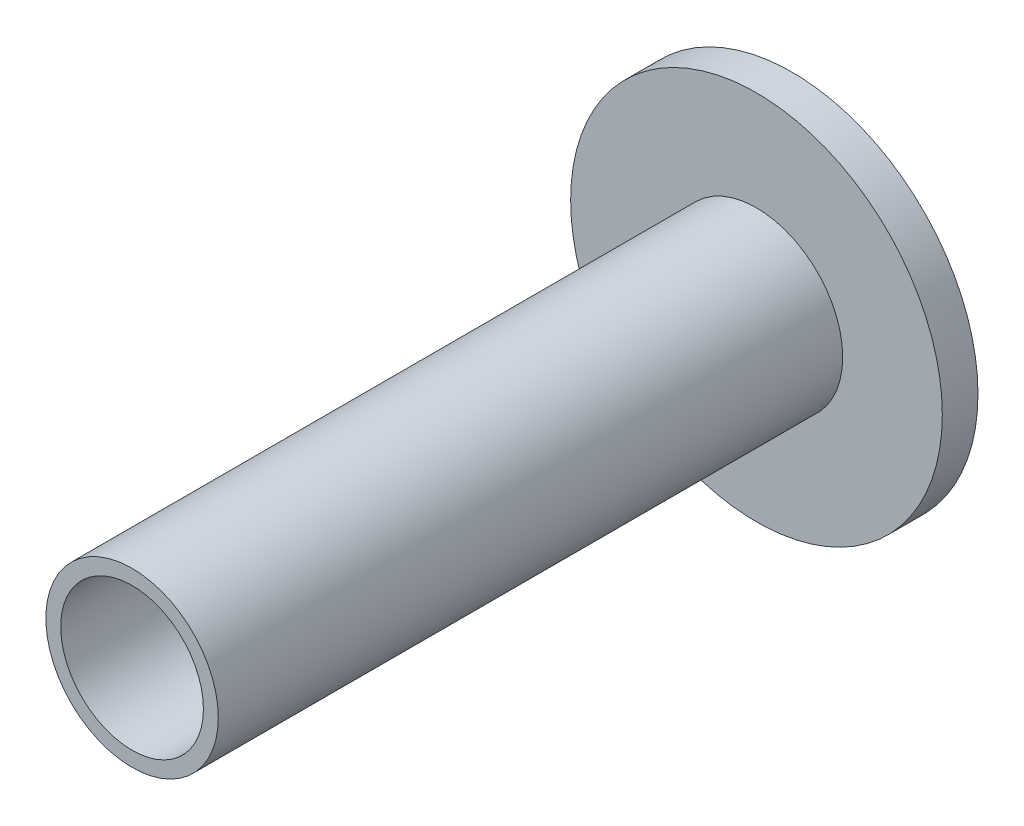
ISO-10303-21;
HEADER;
FILE_DESCRIPTION(('STEP AP214'),'2;1');
FILE_NAME('part.step','',(''),(''),'','','');
FILE_SCHEMA(('AUTOMOTIVE_DESIGN { 1 0 10303 214 1 1 1 1 }'));
ENDSEC;
DATA;
#1=APPLICATION_CONTEXT('core data for automotive mechanical design processes');
#2=APPLICATION_PROTOCOL_DEFINITION('international standard','automotive_design',2000,#1);
#3=PRODUCT_CONTEXT('',#1,'mechanical');
#4=PRODUCT('Part','Part','',(#3));
#5=PRODUCT_RELATED_PRODUCT_CATEGORY('part','',(#4));
#6=PRODUCT_DEFINITION_FORMATION('','',#4);
#7=PRODUCT_DEFINITION_CONTEXT('part definition',#1,'design');
#8=PRODUCT_DEFINITION('design','',#6,#7);
#9=PRODUCT_DEFINITION_SHAPE('','',#8);
#10=(LENGTH_UNIT() NAMED_UNIT(*) SI_UNIT(.MILLI.,.METRE.));
#11=(NAMED_UNIT(*) PLANE_ANGLE_UNIT() SI_UNIT($,.RADIAN.));
#12=(NAMED_UNIT(*) SI_UNIT($,.STERADIAN.) SOLID_ANGLE_UNIT());
#13=UNCERTAINTY_MEASURE_WITH_UNIT(LENGTH_MEASURE(1.E-05),#10,'distance_accuracy_value','');
#14=(GEOMETRIC_REPRESENTATION_CONTEXT(3) GLOBAL_UNCERTAINTY_ASSIGNED_CONTEXT((#13)) GLOBAL_UNIT_ASSIGNED_CONTEXT((#10,
#11,#12)) REPRESENTATION_CONTEXT('',''));
#15=CARTESIAN_POINT('',(0.,0.,0.));
#16=DIRECTION('',(0.,0.,1.));
#17=DIRECTION('',(1.,0.,0.));
#18=AXIS2_PLACEMENT_3D('',#15,#16,#17);
#19=CARTESIAN_POINT('',(0.,0.,210.));
#20=DIRECTION('',(0.,0.,1.));
#21=DIRECTION('',(1.,0.,0.));
#22=AXIS2_PLACEMENT_3D('',#19,#20,#21);
#23=PLANE('',#22);
#24=CARTESIAN_POINT('',(0.,0.,210.));
#25=DIRECTION('',(0.,0.,1.));
#26=DIRECTION('',(1.,0.,0.));
#27=AXIS2_PLACEMENT_3D('',#24,#25,#26);
#28=CIRCLE('',#27,29.);
#29=CARTESIAN_POINT('',(29.,0.,210.));
#30=VERTEX_POINT('',#29);
#31=EDGE_CURVE('E10',#30,#30,#28,.T.);
#32=ORIENTED_EDGE('',*,*,#31,.T.);
#33=EDGE_LOOP('',(#32));
#34=FACE_BOUND('',#33,.T.);
#35=CARTESIAN_POINT('',(0.,0.,210.));
#36=DIRECTION('',(0.,0.,1.));
#37=DIRECTION('',(1.,0.,0.));
#38=AXIS2_PLACEMENT_3D('',#35,#36,#37);
#39=CIRCLE('',#38,24.);
#40=CARTESIAN_POINT('',(24.,0.,210.));
#41=VERTEX_POINT('',#40);
#42=EDGE_CURVE('E42',#41,#41,#39,.T.);
#43=ORIENTED_EDGE('',*,*,#42,.F.);
#44=EDGE_LOOP('',(#43));
#45=FACE_BOUND('',#44,.T.);
#46=ADVANCED_FACE('F34',(#34,#45),#23,.T.);
#47=CARTESIAN_POINT('',(0.,0.,210.));
#48=DIRECTION('',(0.,0.,-1.));
#49=DIRECTION('',(-1.,0.,0.));
#50=AXIS2_PLACEMENT_3D('',#47,#48,#49);
#51=CYLINDRICAL_SURFACE('',#50,29.);
#52=ORIENTED_EDGE('',*,*,#31,.F.);
#53=EDGE_LOOP('',(#52));
#54=FACE_BOUND('',#53,.T.);
#55=CARTESIAN_POINT('',(0.,0.,0.));
#56=DIRECTION('',(0.,0.,1.));
#57=DIRECTION('',(1.,0.,0.));
#58=AXIS2_PLACEMENT_3D('',#55,#56,#57);
#59=CIRCLE('',#58,29.);
#60=CARTESIAN_POINT('',(29.,0.,0.));
#61=VERTEX_POINT('',#60);
#62=EDGE_CURVE('E38',#61,#61,#59,.T.);
#63=ORIENTED_EDGE('',*,*,#62,.T.);
#64=EDGE_LOOP('',(#63));
#65=FACE_BOUND('',#64,.T.);
#66=ADVANCED_FACE('F36',(#54,#65),#51,.T.);
#67=CARTESIAN_POINT('',(0.,0.,210.));
#68=DIRECTION('',(0.,0.,-1.));
#69=DIRECTION('',(-1.,0.,0.));
#70=AXIS2_PLACEMENT_3D('',#67,#68,#69);
#71=CYLINDRICAL_SURFACE('',#70,24.);
#72=ORIENTED_EDGE('',*,*,#42,.T.);
#73=EDGE_LOOP('',(#72));
#74=FACE_BOUND('',#73,.T.);
#75=CARTESIAN_POINT('',(0.,0.,0.));
#76=DIRECTION('',(0.,0.,1.));
#77=DIRECTION('',(1.,0.,0.));
#78=AXIS2_PLACEMENT_3D('',#75,#76,#77);
#79=CIRCLE('',#78,24.);
#80=CARTESIAN_POINT('',(24.,0.,0.));
#81=VERTEX_POINT('',#80);
#82=EDGE_CURVE('E46',#81,#81,#79,.T.);
#83=ORIENTED_EDGE('',*,*,#82,.F.);
#84=EDGE_LOOP('',(#83));
#85=FACE_BOUND('',#84,.T.);
#86=ADVANCED_FACE('F80',(#74,#85),#71,.F.);
#87=CARTESIAN_POINT('',(0.,0.,0.));
#88=DIRECTION('',(0.,0.,-1.));
#89=DIRECTION('',(-1.,0.,0.));
#90=AXIS2_PLACEMENT_3D('',#87,#88,#89);
#91=PLANE('',#90);
#92=CARTESIAN_POINT('',(0.,0.,0.));
#93=DIRECTION('',(0.,0.,-1.));
#94=DIRECTION('',(-1.,0.,0.));
#95=AXIS2_PLACEMENT_3D('',#92,#93,#94);
#96=CIRCLE('',#95,23.7066056191095);
#97=CARTESIAN_POINT('',(-23.7066056191095,0.,0.));
#98=VERTEX_POINT('',#97);
#99=EDGE_CURVE('E58',#98,#98,#96,.T.);
#100=ORIENTED_EDGE('',*,*,#99,.T.);
#101=EDGE_LOOP('',(#100));
#102=FACE_BOUND('',#101,.T.);
#103=ORIENTED_EDGE('',*,*,#82,.T.);
#104=EDGE_LOOP('',(#103));
#105=FACE_BOUND('',#104,.T.);
#106=ADVANCED_FACE('F70',(#102,#105),#91,.F.);
#107=CARTESIAN_POINT('',(0.,0.,-12.));
#108=DIRECTION('',(0.,0.,-1.));
#109=DIRECTION('',(-1.,0.,0.));
#110=AXIS2_PLACEMENT_3D('',#107,#108,#109);
#111=PLANE('',#110);
#112=CARTESIAN_POINT('',(0.,0.,-12.));
#113=DIRECTION('',(0.,0.,-1.));
#114=DIRECTION('',(-1.,0.,0.));
#115=AXIS2_PLACEMENT_3D('',#112,#113,#114);
#116=CIRCLE('',#115,62.5);
#117=CARTESIAN_POINT('',(-62.5,0.,-12.));
#118=VERTEX_POINT('',#117);
#119=EDGE_CURVE('E54',#118,#118,#116,.T.);
#120=ORIENTED_EDGE('',*,*,#119,.T.);
#121=EDGE_LOOP('',(#120));
#122=FACE_BOUND('',#121,.T.);
#123=CARTESIAN_POINT('',(0.,0.,-12.));
#124=DIRECTION('',(0.,0.,-1.));
#125=DIRECTION('',(-1.,0.,0.));
#126=AXIS2_PLACEMENT_3D('',#123,#124,#125);
#127=CIRCLE('',#126,23.7066056191095);
#128=CARTESIAN_POINT('',(-23.7066056191095,0.,-12.));
#129=VERTEX_POINT('',#128);
#130=EDGE_CURVE('E55',#129,#129,#127,.T.);
#131=ORIENTED_EDGE('',*,*,#130,.F.);
#132=EDGE_LOOP('',(#131));
#133=FACE_BOUND('',#132,.T.);
#134=ADVANCED_FACE('F67',(#122,#133),#111,.T.);
#135=ORIENTED_EDGE('',*,*,#62,.F.);
#136=EDGE_LOOP('',(#135));
#137=FACE_BOUND('',#136,.T.);
#138=CARTESIAN_POINT('',(0.,0.,0.));
#139=DIRECTION('',(0.,0.,-1.));
#140=DIRECTION('',(-1.,0.,0.));
#141=AXIS2_PLACEMENT_3D('',#138,#139,#140);
#142=CIRCLE('',#141,62.5);
#143=CARTESIAN_POINT('',(-62.5,0.,0.));
#144=VERTEX_POINT('',#143);
#145=EDGE_CURVE('E51',#144,#144,#142,.T.);
#146=ORIENTED_EDGE('',*,*,#145,.F.);
#147=EDGE_LOOP('',(#146));
#148=FACE_BOUND('',#147,.T.);
#149=ADVANCED_FACE('F69',(#137,#148),#91,.F.);
#150=CARTESIAN_POINT('',(0.,0.,-12.));
#151=DIRECTION('',(0.,0.,1.));
#152=DIRECTION('',(1.,0.,0.));
#153=AXIS2_PLACEMENT_3D('',#150,#151,#152);
#154=CYLINDRICAL_SURFACE('',#153,62.5);
#155=ORIENTED_EDGE('',*,*,#119,.F.);
#156=EDGE_LOOP('',(#155));
#157=FACE_BOUND('',#156,.T.);
#158=ORIENTED_EDGE('',*,*,#145,.T.);
#159=EDGE_LOOP('',(#158));
#160=FACE_BOUND('',#159,.T.);
#161=ADVANCED_FACE('F77',(#157,#160),#154,.T.);
#162=CARTESIAN_POINT('',(0.,0.,-12.));
#163=DIRECTION('',(0.,0.,1.));
#164=DIRECTION('',(1.,0.,0.));
#165=AXIS2_PLACEMENT_3D('',#162,#163,#164);
#166=CYLINDRICAL_SURFACE('',#165,23.7066056191095);
#167=ORIENTED_EDGE('',*,*,#130,.T.);
#168=EDGE_LOOP('',(#167));
#169=FACE_BOUND('',#168,.T.);
#170=ORIENTED_EDGE('',*,*,#99,.F.);
#171=EDGE_LOOP('',(#170));
#172=FACE_BOUND('',#171,.T.);
#173=ADVANCED_FACE('F64',(#169,#172),#166,.F.);
#174=CLOSED_SHELL('',(#46,#66,#86,#106,#134,#149,#161,#173));
#175=MANIFOLD_SOLID_BREP('B2',#174);
#176=ADVANCED_BREP_SHAPE_REPRESENTATION('',(#18,#175),#14);
#177=SHAPE_DEFINITION_REPRESENTATION(#9,#176);
ENDSEC;
END-ISO-10303-21;
